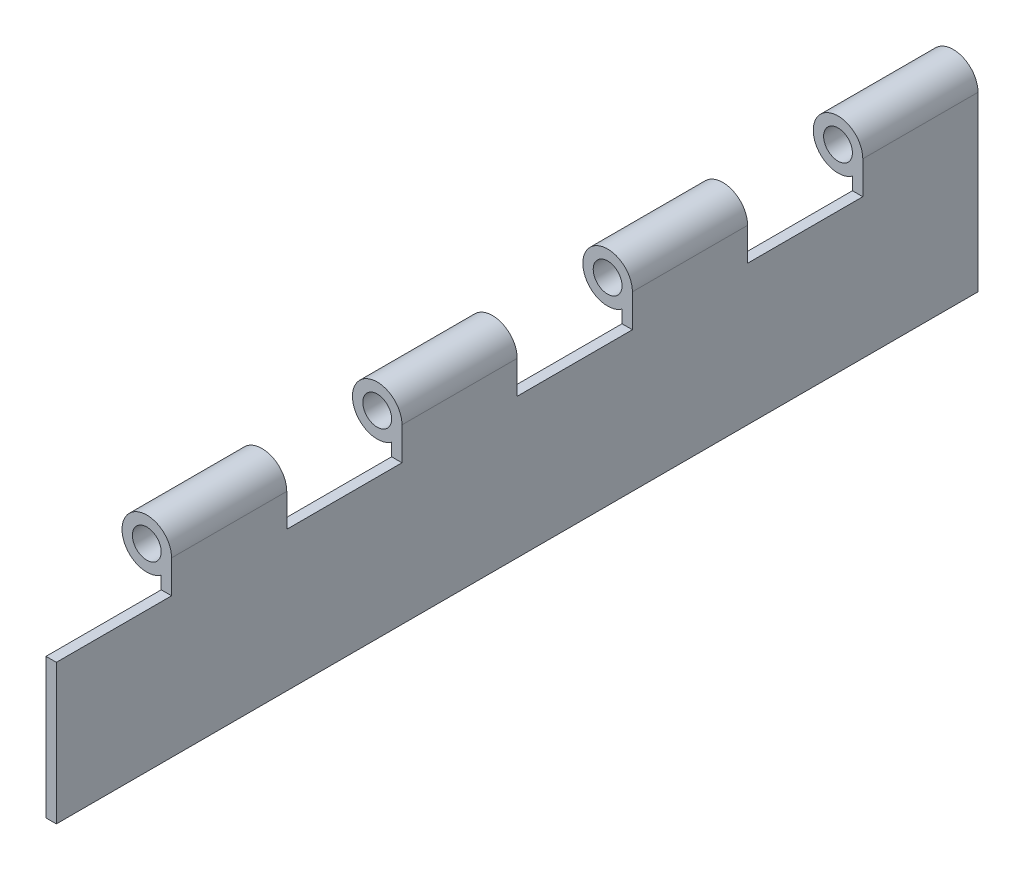
ISO-10303-21;
HEADER;
FILE_DESCRIPTION(('STEP AP214'),'2;1');
FILE_NAME('part.step','',(''),(''),'','','');
FILE_SCHEMA(('AUTOMOTIVE_DESIGN { 1 0 10303 214 1 1 1 1 }'));
ENDSEC;
DATA;
#1=APPLICATION_CONTEXT('core data for automotive mechanical design processes');
#2=APPLICATION_PROTOCOL_DEFINITION('international standard','automotive_design',2000,#1);
#3=PRODUCT_CONTEXT('',#1,'mechanical');
#4=PRODUCT('Part','Part','',(#3));
#5=PRODUCT_RELATED_PRODUCT_CATEGORY('part','',(#4));
#6=PRODUCT_DEFINITION_FORMATION('','',#4);
#7=PRODUCT_DEFINITION_CONTEXT('part definition',#1,'design');
#8=PRODUCT_DEFINITION('design','',#6,#7);
#9=PRODUCT_DEFINITION_SHAPE('','',#8);
#10=(LENGTH_UNIT() NAMED_UNIT(*) SI_UNIT(.MILLI.,.METRE.));
#11=(NAMED_UNIT(*) PLANE_ANGLE_UNIT() SI_UNIT($,.RADIAN.));
#12=(NAMED_UNIT(*) SI_UNIT($,.STERADIAN.) SOLID_ANGLE_UNIT());
#13=UNCERTAINTY_MEASURE_WITH_UNIT(LENGTH_MEASURE(1.E-05),#10,'distance_accuracy_value','');
#14=(GEOMETRIC_REPRESENTATION_CONTEXT(3) GLOBAL_UNCERTAINTY_ASSIGNED_CONTEXT((#13)) GLOBAL_UNIT_ASSIGNED_CONTEXT((#10,
#11,#12)) REPRESENTATION_CONTEXT('',''));
#15=CARTESIAN_POINT('',(0.,0.,0.));
#16=DIRECTION('',(0.,0.,1.));
#17=DIRECTION('',(1.,0.,0.));
#18=AXIS2_PLACEMENT_3D('',#15,#16,#17);
#19=CARTESIAN_POINT('',(0.,0.,203.2));
#20=DIRECTION('',(0.,0.,-1.));
#21=DIRECTION('',(-1.,0.,0.));
#22=AXIS2_PLACEMENT_3D('',#19,#20,#21);
#23=CYLINDRICAL_SURFACE('',#22,5.461);
#24=DIRECTION('',(0.,0.,-1.));
#25=VECTOR('',#24,1.);
#26=CARTESIAN_POINT('',(5.461,0.,203.2));
#27=LINE('',#26,#25);
#28=CARTESIAN_POINT('',(5.461,0.,177.8));
#29=VERTEX_POINT('',#28);
#30=CARTESIAN_POINT('',(5.461,0.,152.4));
#31=VERTEX_POINT('',#30);
#32=EDGE_CURVE('E293',#29,#31,#27,.T.);
#33=ORIENTED_EDGE('',*,*,#32,.T.);
#34=CARTESIAN_POINT('',(0.,0.,152.4));
#35=DIRECTION('',(0.,0.,1.));
#36=DIRECTION('',(1.,0.,0.));
#37=AXIS2_PLACEMENT_3D('',#34,#35,#36);
#38=CIRCLE('',#37,5.461);
#39=CARTESIAN_POINT('',(3.17500000000001,-4.44318534387211,152.4));
#40=VERTEX_POINT('',#39);
#41=EDGE_CURVE('E243',#31,#40,#38,.T.);
#42=ORIENTED_EDGE('',*,*,#41,.T.);
#43=DIRECTION('',(0.,0.,-1.));
#44=VECTOR('',#43,1.);
#45=CARTESIAN_POINT('',(3.17500000000001,-4.44318534387211,203.2));
#46=LINE('',#45,#44);
#47=CARTESIAN_POINT('',(3.17500000000001,-4.44318534387211,177.8));
#48=VERTEX_POINT('',#47);
#49=EDGE_CURVE('E11',#48,#40,#46,.T.);
#50=ORIENTED_EDGE('',*,*,#49,.F.);
#51=CARTESIAN_POINT('',(0.,0.,177.8));
#52=DIRECTION('',(0.,0.,-1.));
#53=DIRECTION('',(-1.,0.,0.));
#54=AXIS2_PLACEMENT_3D('',#51,#52,#53);
#55=CIRCLE('',#54,5.461);
#56=EDGE_CURVE('E267',#48,#29,#55,.T.);
#57=ORIENTED_EDGE('',*,*,#56,.T.);
#58=EDGE_LOOP('',(#33,#42,#50,#57));
#59=FACE_BOUND('',#58,.T.);
#60=ADVANCED_FACE('F34',(#59),#23,.T.);
#61=CARTESIAN_POINT('',(3.17500000000001,-4.44318534387211,127.));
#62=VERTEX_POINT('',#61);
#63=CARTESIAN_POINT('',(3.17500000000001,-4.44318534387211,101.6));
#64=VERTEX_POINT('',#63);
#65=EDGE_CURVE('E43',#62,#64,#46,.T.);
#66=ORIENTED_EDGE('',*,*,#65,.F.);
#67=CARTESIAN_POINT('',(0.,0.,127.));
#68=DIRECTION('',(0.,0.,-1.));
#69=DIRECTION('',(-1.,0.,0.));
#70=AXIS2_PLACEMENT_3D('',#67,#68,#69);
#71=CIRCLE('',#70,5.461);
#72=CARTESIAN_POINT('',(5.461,0.,127.));
#73=VERTEX_POINT('',#72);
#74=EDGE_CURVE('E238',#62,#73,#71,.T.);
#75=ORIENTED_EDGE('',*,*,#74,.T.);
#76=CARTESIAN_POINT('',(5.461,0.,101.6));
#77=VERTEX_POINT('',#76);
#78=EDGE_CURVE('E184',#73,#77,#27,.T.);
#79=ORIENTED_EDGE('',*,*,#78,.T.);
#80=CARTESIAN_POINT('',(0.,0.,101.6));
#81=DIRECTION('',(0.,0.,1.));
#82=DIRECTION('',(1.,0.,0.));
#83=AXIS2_PLACEMENT_3D('',#80,#81,#82);
#84=CIRCLE('',#83,5.461);
#85=EDGE_CURVE('E234',#77,#64,#84,.T.);
#86=ORIENTED_EDGE('',*,*,#85,.T.);
#87=EDGE_LOOP('',(#66,#75,#79,#86));
#88=FACE_BOUND('',#87,.T.);
#89=ADVANCED_FACE('F338',(#88),#23,.T.);
#90=CARTESIAN_POINT('',(3.17500000000001,-4.44318534387211,76.2));
#91=VERTEX_POINT('',#90);
#92=CARTESIAN_POINT('',(3.17500000000001,-4.44318534387211,50.8));
#93=VERTEX_POINT('',#92);
#94=EDGE_CURVE('E368',#91,#93,#46,.T.);
#95=ORIENTED_EDGE('',*,*,#94,.F.);
#96=CARTESIAN_POINT('',(0.,0.,76.2));
#97=DIRECTION('',(0.,0.,-1.));
#98=DIRECTION('',(-1.,0.,0.));
#99=AXIS2_PLACEMENT_3D('',#96,#97,#98);
#100=CIRCLE('',#99,5.461);
#101=CARTESIAN_POINT('',(5.461,0.,76.2));
#102=VERTEX_POINT('',#101);
#103=EDGE_CURVE('E228',#91,#102,#100,.T.);
#104=ORIENTED_EDGE('',*,*,#103,.T.);
#105=CARTESIAN_POINT('',(5.461,0.,50.8));
#106=VERTEX_POINT('',#105);
#107=EDGE_CURVE('E380',#102,#106,#27,.T.);
#108=ORIENTED_EDGE('',*,*,#107,.T.);
#109=CARTESIAN_POINT('',(0.,0.,50.8));
#110=DIRECTION('',(0.,0.,1.));
#111=DIRECTION('',(1.,0.,0.));
#112=AXIS2_PLACEMENT_3D('',#109,#110,#111);
#113=CIRCLE('',#112,5.461);
#114=EDGE_CURVE('E222',#106,#93,#113,.T.);
#115=ORIENTED_EDGE('',*,*,#114,.T.);
#116=EDGE_LOOP('',(#95,#104,#108,#115));
#117=FACE_BOUND('',#116,.T.);
#118=ADVANCED_FACE('F343',(#117),#23,.T.);
#119=CARTESIAN_POINT('',(0.,0.,203.2));
#120=DIRECTION('',(0.,0.,-1.));
#121=DIRECTION('',(-1.,0.,0.));
#122=AXIS2_PLACEMENT_3D('',#119,#120,#121);
#123=CYLINDRICAL_SURFACE('',#122,3.175);
#124=CARTESIAN_POINT('',(0.,0.,152.4));
#125=DIRECTION('',(0.,0.,1.));
#126=DIRECTION('',(1.,0.,0.));
#127=AXIS2_PLACEMENT_3D('',#124,#125,#126);
#128=CIRCLE('',#127,3.175);
#129=CARTESIAN_POINT('',(3.175,0.,152.4));
#130=VERTEX_POINT('',#129);
#131=EDGE_CURVE('E38',#130,#130,#128,.T.);
#132=ORIENTED_EDGE('',*,*,#131,.F.);
#133=EDGE_LOOP('',(#132));
#134=FACE_BOUND('',#133,.T.);
#135=CARTESIAN_POINT('',(0.,0.,177.8));
#136=DIRECTION('',(0.,0.,-1.));
#137=DIRECTION('',(-1.,0.,0.));
#138=AXIS2_PLACEMENT_3D('',#135,#136,#137);
#139=CIRCLE('',#138,3.175);
#140=CARTESIAN_POINT('',(-3.175,0.,177.8));
#141=VERTEX_POINT('',#140);
#142=EDGE_CURVE('E262',#141,#141,#139,.T.);
#143=ORIENTED_EDGE('',*,*,#142,.F.);
#144=EDGE_LOOP('',(#143));
#145=FACE_BOUND('',#144,.T.);
#146=ADVANCED_FACE('F321',(#134,#145),#123,.F.);
#147=CARTESIAN_POINT('',(0.,0.,203.2));
#148=DIRECTION('',(0.,0.,1.));
#149=DIRECTION('',(1.,0.,0.));
#150=AXIS2_PLACEMENT_3D('',#147,#148,#149);
#151=PLANE('',#150);
#152=DIRECTION('',(1.,0.,0.));
#153=VECTOR('',#152,1.);
#154=CARTESIAN_POINT('',(-5.461,-7.239,203.2));
#155=LINE('',#154,#153);
#156=CARTESIAN_POINT('',(3.17500000000001,-7.239,203.2));
#157=VERTEX_POINT('',#156);
#158=CARTESIAN_POINT('',(5.461,-7.239,203.2));
#159=VERTEX_POINT('',#158);
#160=EDGE_CURVE('E259',#157,#159,#155,.T.);
#161=ORIENTED_EDGE('',*,*,#160,.F.);
#162=DIRECTION('',(0.,-1.,0.));
#163=VECTOR('',#162,1.);
#164=CARTESIAN_POINT('',(3.17500000000001,-38.1,203.2));
#165=LINE('',#164,#163);
#166=CARTESIAN_POINT('',(3.17500000000001,-38.1,203.2));
#167=VERTEX_POINT('',#166);
#168=EDGE_CURVE('E276',#157,#167,#165,.T.);
#169=ORIENTED_EDGE('',*,*,#168,.T.);
#170=DIRECTION('',(1.,0.,0.));
#171=VECTOR('',#170,1.);
#172=CARTESIAN_POINT('',(5.461,-38.1,203.2));
#173=LINE('',#172,#171);
#174=CARTESIAN_POINT('',(5.461,-38.1,203.2));
#175=VERTEX_POINT('',#174);
#176=EDGE_CURVE('E278',#167,#175,#173,.T.);
#177=ORIENTED_EDGE('',*,*,#176,.T.);
#178=DIRECTION('',(0.,1.,0.));
#179=VECTOR('',#178,1.);
#180=CARTESIAN_POINT('',(5.461,0.,203.2));
#181=LINE('',#180,#179);
#182=EDGE_CURVE('E281',#175,#159,#181,.T.);
#183=ORIENTED_EDGE('',*,*,#182,.T.);
#184=EDGE_LOOP('',(#161,#169,#177,#183));
#185=FACE_BOUND('',#184,.T.);
#186=ADVANCED_FACE('F355',(#185),#151,.T.);
#187=CARTESIAN_POINT('',(0.,0.,0.));
#188=DIRECTION('',(0.,0.,1.));
#189=DIRECTION('',(1.,0.,0.));
#190=AXIS2_PLACEMENT_3D('',#187,#188,#189);
#191=PLANE('',#190);
#192=CARTESIAN_POINT('',(0.,0.,0.));
#193=DIRECTION('',(0.,0.,1.));
#194=DIRECTION('',(1.,0.,0.));
#195=AXIS2_PLACEMENT_3D('',#192,#193,#194);
#196=CIRCLE('',#195,5.461);
#197=CARTESIAN_POINT('',(5.461,0.,0.));
#198=VERTEX_POINT('',#197);
#199=CARTESIAN_POINT('',(3.17500000000001,-4.44318534387211,0.));
#200=VERTEX_POINT('',#199);
#201=EDGE_CURVE('E275',#198,#200,#196,.T.);
#202=ORIENTED_EDGE('',*,*,#201,.F.);
#203=DIRECTION('',(0.,1.,0.));
#204=VECTOR('',#203,1.);
#205=CARTESIAN_POINT('',(5.461,0.,0.));
#206=LINE('',#205,#204);
#207=CARTESIAN_POINT('',(5.461,-38.1,0.));
#208=VERTEX_POINT('',#207);
#209=EDGE_CURVE('E279',#208,#198,#206,.T.);
#210=ORIENTED_EDGE('',*,*,#209,.F.);
#211=DIRECTION('',(1.,0.,0.));
#212=VECTOR('',#211,1.);
#213=CARTESIAN_POINT('',(5.461,-38.1,0.));
#214=LINE('',#213,#212);
#215=CARTESIAN_POINT('',(3.17500000000001,-38.1,0.));
#216=VERTEX_POINT('',#215);
#217=EDGE_CURVE('E289',#216,#208,#214,.T.);
#218=ORIENTED_EDGE('',*,*,#217,.F.);
#219=DIRECTION('',(0.,-1.,0.));
#220=VECTOR('',#219,1.);
#221=CARTESIAN_POINT('',(3.17500000000001,-38.1,0.));
#222=LINE('',#221,#220);
#223=EDGE_CURVE('E287',#200,#216,#222,.T.);
#224=ORIENTED_EDGE('',*,*,#223,.F.);
#225=EDGE_LOOP('',(#202,#210,#218,#224));
#226=FACE_BOUND('',#225,.T.);
#227=CARTESIAN_POINT('',(0.,0.,0.));
#228=DIRECTION('',(0.,0.,1.));
#229=DIRECTION('',(1.,0.,0.));
#230=AXIS2_PLACEMENT_3D('',#227,#228,#229);
#231=CIRCLE('',#230,3.175);
#232=CARTESIAN_POINT('',(3.175,0.,0.));
#233=VERTEX_POINT('',#232);
#234=EDGE_CURVE('E272',#233,#233,#231,.T.);
#235=ORIENTED_EDGE('',*,*,#234,.T.);
#236=EDGE_LOOP('',(#235));
#237=FACE_BOUND('',#236,.T.);
#238=ADVANCED_FACE('F347',(#226,#237),#191,.F.);
#239=CARTESIAN_POINT('',(3.17500000000001,-4.44318534387211,25.4));
#240=VERTEX_POINT('',#239);
#241=EDGE_CURVE('E45',#240,#200,#46,.T.);
#242=ORIENTED_EDGE('',*,*,#241,.F.);
#243=CARTESIAN_POINT('',(0.,0.,25.4));
#244=DIRECTION('',(0.,0.,-1.));
#245=DIRECTION('',(-1.,0.,0.));
#246=AXIS2_PLACEMENT_3D('',#243,#244,#245);
#247=CIRCLE('',#246,5.461);
#248=CARTESIAN_POINT('',(5.461,0.,25.4));
#249=VERTEX_POINT('',#248);
#250=EDGE_CURVE('E216',#240,#249,#247,.T.);
#251=ORIENTED_EDGE('',*,*,#250,.T.);
#252=EDGE_CURVE('E284',#249,#198,#27,.T.);
#253=ORIENTED_EDGE('',*,*,#252,.T.);
#254=ORIENTED_EDGE('',*,*,#201,.T.);
#255=EDGE_LOOP('',(#242,#251,#253,#254));
#256=FACE_BOUND('',#255,.T.);
#257=ADVANCED_FACE('F36',(#256),#23,.T.);
#258=CARTESIAN_POINT('',(3.17500000000001,-38.1,203.2));
#259=DIRECTION('',(1.,0.,0.));
#260=DIRECTION('',(0.,1.,0.));
#261=AXIS2_PLACEMENT_3D('',#258,#259,#260);
#262=PLANE('',#261);
#263=ORIENTED_EDGE('',*,*,#49,.T.);
#264=DIRECTION('',(0.,-1.,0.));
#265=VECTOR('',#264,1.);
#266=CARTESIAN_POINT('',(3.17500000000001,-38.1,152.4));
#267=LINE('',#266,#265);
#268=CARTESIAN_POINT('',(3.17500000000001,-7.239,152.4));
#269=VERTEX_POINT('',#268);
#270=EDGE_CURVE('E240',#40,#269,#267,.T.);
#271=ORIENTED_EDGE('',*,*,#270,.T.);
#272=DIRECTION('',(0.,0.,-1.));
#273=VECTOR('',#272,1.);
#274=CARTESIAN_POINT('',(3.17500000000001,-7.239,203.2));
#275=LINE('',#274,#273);
#276=CARTESIAN_POINT('',(3.17500000000001,-7.239,127.));
#277=VERTEX_POINT('',#276);
#278=EDGE_CURVE('E251',#269,#277,#275,.T.);
#279=ORIENTED_EDGE('',*,*,#278,.T.);
#280=DIRECTION('',(0.,1.,0.));
#281=VECTOR('',#280,1.);
#282=CARTESIAN_POINT('',(3.17500000000001,-38.1,127.));
#283=LINE('',#282,#281);
#284=EDGE_CURVE('E171',#277,#62,#283,.T.);
#285=ORIENTED_EDGE('',*,*,#284,.T.);
#286=ORIENTED_EDGE('',*,*,#65,.T.);
#287=DIRECTION('',(0.,-1.,0.));
#288=VECTOR('',#287,1.);
#289=CARTESIAN_POINT('',(3.17500000000001,-38.1,101.6));
#290=LINE('',#289,#288);
#291=CARTESIAN_POINT('',(3.17500000000001,-7.239,101.6));
#292=VERTEX_POINT('',#291);
#293=EDGE_CURVE('E231',#64,#292,#290,.T.);
#294=ORIENTED_EDGE('',*,*,#293,.T.);
#295=DIRECTION('',(0.,0.,-1.));
#296=VECTOR('',#295,1.);
#297=CARTESIAN_POINT('',(3.17500000000001,-7.239,203.2));
#298=LINE('',#297,#296);
#299=CARTESIAN_POINT('',(3.17500000000001,-7.239,76.2));
#300=VERTEX_POINT('',#299);
#301=EDGE_CURVE('E248',#292,#300,#298,.T.);
#302=ORIENTED_EDGE('',*,*,#301,.T.);
#303=DIRECTION('',(0.,1.,0.));
#304=VECTOR('',#303,1.);
#305=CARTESIAN_POINT('',(3.17500000000001,-38.1,76.2));
#306=LINE('',#305,#304);
#307=EDGE_CURVE('E225',#300,#91,#306,.T.);
#308=ORIENTED_EDGE('',*,*,#307,.T.);
#309=ORIENTED_EDGE('',*,*,#94,.T.);
#310=DIRECTION('',(0.,-1.,0.));
#311=VECTOR('',#310,1.);
#312=CARTESIAN_POINT('',(3.17500000000001,-38.1,50.8));
#313=LINE('',#312,#311);
#314=CARTESIAN_POINT('',(3.17500000000001,-7.239,50.8));
#315=VERTEX_POINT('',#314);
#316=EDGE_CURVE('E219',#93,#315,#313,.T.);
#317=ORIENTED_EDGE('',*,*,#316,.T.);
#318=DIRECTION('',(0.,0.,-1.));
#319=VECTOR('',#318,1.);
#320=CARTESIAN_POINT('',(3.17500000000001,-7.239,203.2));
#321=LINE('',#320,#319);
#322=CARTESIAN_POINT('',(3.17500000000001,-7.239,25.4));
#323=VERTEX_POINT('',#322);
#324=EDGE_CURVE('E245',#315,#323,#321,.T.);
#325=ORIENTED_EDGE('',*,*,#324,.T.);
#326=DIRECTION('',(0.,1.,0.));
#327=VECTOR('',#326,1.);
#328=CARTESIAN_POINT('',(3.17500000000001,-38.1,25.4));
#329=LINE('',#328,#327);
#330=EDGE_CURVE('E213',#323,#240,#329,.T.);
#331=ORIENTED_EDGE('',*,*,#330,.T.);
#332=ORIENTED_EDGE('',*,*,#241,.T.);
#333=ORIENTED_EDGE('',*,*,#223,.T.);
#334=DIRECTION('',(0.,0.,-1.));
#335=VECTOR('',#334,1.);
#336=CARTESIAN_POINT('',(3.17500000000001,-38.1,203.2));
#337=LINE('',#336,#335);
#338=EDGE_CURVE('E299',#167,#216,#337,.T.);
#339=ORIENTED_EDGE('',*,*,#338,.F.);
#340=ORIENTED_EDGE('',*,*,#168,.F.);
#341=DIRECTION('',(0.,0.,-1.));
#342=VECTOR('',#341,1.);
#343=CARTESIAN_POINT('',(3.17500000000001,-7.239,203.2));
#344=LINE('',#343,#342);
#345=CARTESIAN_POINT('',(3.17500000000001,-7.239,177.8));
#346=VERTEX_POINT('',#345);
#347=EDGE_CURVE('E269',#157,#346,#344,.T.);
#348=ORIENTED_EDGE('',*,*,#347,.T.);
#349=DIRECTION('',(0.,1.,0.));
#350=VECTOR('',#349,1.);
#351=CARTESIAN_POINT('',(3.17500000000001,-38.1,177.8));
#352=LINE('',#351,#350);
#353=EDGE_CURVE('E264',#346,#48,#352,.T.);
#354=ORIENTED_EDGE('',*,*,#353,.T.);
#355=EDGE_LOOP('',(#263,#271,#279,#285,#286,#294,#302,#308,#309,#317,#325,#331,#332,#333,#339,
#340,#348,#354));
#356=FACE_BOUND('',#355,.T.);
#357=ADVANCED_FACE('F346',(#356),#262,.F.);
#358=CARTESIAN_POINT('',(5.461,-38.1,203.2));
#359=DIRECTION('',(0.,1.,0.));
#360=DIRECTION('',(0.,0.,1.));
#361=AXIS2_PLACEMENT_3D('',#358,#359,#360);
#362=PLANE('',#361);
#363=ORIENTED_EDGE('',*,*,#217,.T.);
#364=DIRECTION('',(0.,0.,-1.));
#365=VECTOR('',#364,1.);
#366=CARTESIAN_POINT('',(5.461,-38.1,203.2));
#367=LINE('',#366,#365);
#368=EDGE_CURVE('E296',#175,#208,#367,.T.);
#369=ORIENTED_EDGE('',*,*,#368,.F.);
#370=ORIENTED_EDGE('',*,*,#176,.F.);
#371=ORIENTED_EDGE('',*,*,#338,.T.);
#372=EDGE_LOOP('',(#363,#369,#370,#371));
#373=FACE_BOUND('',#372,.T.);
#374=ADVANCED_FACE('F353',(#373),#362,.F.);
#375=CARTESIAN_POINT('',(5.461,0.,203.2));
#376=DIRECTION('',(-1.,0.,0.));
#377=DIRECTION('',(0.,-1.,0.));
#378=AXIS2_PLACEMENT_3D('',#375,#376,#377);
#379=PLANE('',#378);
#380=DIRECTION('',(0.,0.,-1.));
#381=VECTOR('',#380,1.);
#382=CARTESIAN_POINT('',(5.461,-7.239,152.4));
#383=LINE('',#382,#381);
#384=CARTESIAN_POINT('',(5.461,-7.239,152.4));
#385=VERTEX_POINT('',#384);
#386=CARTESIAN_POINT('',(5.461,-7.239,127.));
#387=VERTEX_POINT('',#386);
#388=EDGE_CURVE('E178',#385,#387,#383,.T.);
#389=ORIENTED_EDGE('',*,*,#388,.F.);
#390=DIRECTION('',(0.,-1.,0.));
#391=VECTOR('',#390,1.);
#392=CARTESIAN_POINT('',(5.461,5.461,152.4));
#393=LINE('',#392,#391);
#394=EDGE_CURVE('E52',#31,#385,#393,.T.);
#395=ORIENTED_EDGE('',*,*,#394,.F.);
#396=ORIENTED_EDGE('',*,*,#32,.F.);
#397=DIRECTION('',(0.,1.,0.));
#398=VECTOR('',#397,1.);
#399=CARTESIAN_POINT('',(5.461,5.461,177.8));
#400=LINE('',#399,#398);
#401=CARTESIAN_POINT('',(5.461,-7.239,177.8));
#402=VERTEX_POINT('',#401);
#403=EDGE_CURVE('E256',#402,#29,#400,.T.);
#404=ORIENTED_EDGE('',*,*,#403,.F.);
#405=DIRECTION('',(0.,0.,-1.));
#406=VECTOR('',#405,1.);
#407=CARTESIAN_POINT('',(5.461,-7.239,203.2));
#408=LINE('',#407,#406);
#409=EDGE_CURVE('E253',#159,#402,#408,.T.);
#410=ORIENTED_EDGE('',*,*,#409,.F.);
#411=ORIENTED_EDGE('',*,*,#182,.F.);
#412=ORIENTED_EDGE('',*,*,#368,.T.);
#413=ORIENTED_EDGE('',*,*,#209,.T.);
#414=ORIENTED_EDGE('',*,*,#252,.F.);
#415=DIRECTION('',(0.,1.,0.));
#416=VECTOR('',#415,1.);
#417=CARTESIAN_POINT('',(5.461,5.461,25.4));
#418=LINE('',#417,#416);
#419=CARTESIAN_POINT('',(5.461,-7.239,25.4));
#420=VERTEX_POINT('',#419);
#421=EDGE_CURVE('E206',#420,#249,#418,.T.);
#422=ORIENTED_EDGE('',*,*,#421,.F.);
#423=DIRECTION('',(0.,0.,-1.));
#424=VECTOR('',#423,1.);
#425=CARTESIAN_POINT('',(5.461,-7.239,50.8));
#426=LINE('',#425,#424);
#427=CARTESIAN_POINT('',(5.461,-7.239,50.8));
#428=VERTEX_POINT('',#427);
#429=EDGE_CURVE('E203',#428,#420,#426,.T.);
#430=ORIENTED_EDGE('',*,*,#429,.F.);
#431=DIRECTION('',(0.,-1.,0.));
#432=VECTOR('',#431,1.);
#433=CARTESIAN_POINT('',(5.461,5.461,50.8));
#434=LINE('',#433,#432);
#435=EDGE_CURVE('E201',#106,#428,#434,.T.);
#436=ORIENTED_EDGE('',*,*,#435,.F.);
#437=ORIENTED_EDGE('',*,*,#107,.F.);
#438=DIRECTION('',(0.,1.,0.));
#439=VECTOR('',#438,1.);
#440=CARTESIAN_POINT('',(5.461,5.461,76.2));
#441=LINE('',#440,#439);
#442=CARTESIAN_POINT('',(5.461,-7.239,76.2));
#443=VERTEX_POINT('',#442);
#444=EDGE_CURVE('E194',#443,#102,#441,.T.);
#445=ORIENTED_EDGE('',*,*,#444,.F.);
#446=DIRECTION('',(0.,0.,-1.));
#447=VECTOR('',#446,1.);
#448=CARTESIAN_POINT('',(5.461,-7.239,101.6));
#449=LINE('',#448,#447);
#450=CARTESIAN_POINT('',(5.461,-7.239,101.6));
#451=VERTEX_POINT('',#450);
#452=EDGE_CURVE('E190',#451,#443,#449,.T.);
#453=ORIENTED_EDGE('',*,*,#452,.F.);
#454=DIRECTION('',(0.,-1.,0.));
#455=VECTOR('',#454,1.);
#456=CARTESIAN_POINT('',(5.461,5.461,101.6));
#457=LINE('',#456,#455);
#458=EDGE_CURVE('E60',#77,#451,#457,.T.);
#459=ORIENTED_EDGE('',*,*,#458,.F.);
#460=ORIENTED_EDGE('',*,*,#78,.F.);
#461=DIRECTION('',(0.,1.,0.));
#462=VECTOR('',#461,1.);
#463=CARTESIAN_POINT('',(5.461,5.461,127.));
#464=LINE('',#463,#462);
#465=EDGE_CURVE('E168',#387,#73,#464,.T.);
#466=ORIENTED_EDGE('',*,*,#465,.F.);
#467=EDGE_LOOP('',(#389,#395,#396,#404,#410,#411,#412,#413,#414,#422,#430,#436,#437,#445,#453,
#459,#460,#466));
#468=FACE_BOUND('',#467,.T.);
#469=ADVANCED_FACE('F182',(#468),#379,.F.);
#470=CARTESIAN_POINT('',(0.,0.,25.4));
#471=DIRECTION('',(0.,0.,-1.));
#472=DIRECTION('',(-1.,0.,0.));
#473=AXIS2_PLACEMENT_3D('',#470,#471,#472);
#474=CIRCLE('',#473,3.175);
#475=CARTESIAN_POINT('',(-3.175,0.,25.4));
#476=VERTEX_POINT('',#475);
#477=EDGE_CURVE('E174',#476,#476,#474,.T.);
#478=ORIENTED_EDGE('',*,*,#477,.F.);
#479=EDGE_LOOP('',(#478));
#480=FACE_BOUND('',#479,.T.);
#481=ORIENTED_EDGE('',*,*,#234,.F.);
#482=EDGE_LOOP('',(#481));
#483=FACE_BOUND('',#482,.T.);
#484=ADVANCED_FACE('F365',(#480,#483),#123,.F.);
#485=CARTESIAN_POINT('',(-5.461,-7.239,203.2));
#486=DIRECTION('',(0.,-1.,0.));
#487=DIRECTION('',(1.,0.,0.));
#488=AXIS2_PLACEMENT_3D('',#485,#486,#487);
#489=PLANE('',#488);
#490=ORIENTED_EDGE('',*,*,#160,.T.);
#491=ORIENTED_EDGE('',*,*,#409,.T.);
#492=DIRECTION('',(1.,0.,0.));
#493=VECTOR('',#492,1.);
#494=CARTESIAN_POINT('',(-5.461,-7.239,177.8));
#495=LINE('',#494,#493);
#496=EDGE_CURVE('E260',#346,#402,#495,.T.);
#497=ORIENTED_EDGE('',*,*,#496,.F.);
#498=ORIENTED_EDGE('',*,*,#347,.F.);
#499=EDGE_LOOP('',(#490,#491,#497,#498));
#500=FACE_BOUND('',#499,.T.);
#501=ADVANCED_FACE('F390',(#500),#489,.F.);
#502=CARTESIAN_POINT('',(-5.461,5.461,177.8));
#503=DIRECTION('',(0.,0.,-1.));
#504=DIRECTION('',(-1.,0.,0.));
#505=AXIS2_PLACEMENT_3D('',#502,#503,#504);
#506=PLANE('',#505);
#507=ORIENTED_EDGE('',*,*,#142,.T.);
#508=EDGE_LOOP('',(#507));
#509=FACE_BOUND('',#508,.T.);
#510=ORIENTED_EDGE('',*,*,#56,.F.);
#511=ORIENTED_EDGE('',*,*,#353,.F.);
#512=ORIENTED_EDGE('',*,*,#496,.T.);
#513=ORIENTED_EDGE('',*,*,#403,.T.);
#514=EDGE_LOOP('',(#510,#511,#512,#513));
#515=FACE_BOUND('',#514,.T.);
#516=ADVANCED_FACE('F395',(#509,#515),#506,.F.);
#517=CARTESIAN_POINT('',(-5.46100000000001,-7.239,50.8));
#518=DIRECTION('',(0.,-1.,0.));
#519=DIRECTION('',(1.,0.,0.));
#520=AXIS2_PLACEMENT_3D('',#517,#518,#519);
#521=PLANE('',#520);
#522=DIRECTION('',(1.,0.,0.));
#523=VECTOR('',#522,1.);
#524=CARTESIAN_POINT('',(-5.46100000000001,-7.239,50.8));
#525=LINE('',#524,#523);
#526=EDGE_CURVE('E209',#315,#428,#525,.T.);
#527=ORIENTED_EDGE('',*,*,#526,.T.);
#528=ORIENTED_EDGE('',*,*,#429,.T.);
#529=DIRECTION('',(1.,0.,0.));
#530=VECTOR('',#529,1.);
#531=CARTESIAN_POINT('',(-5.46100000000001,-7.239,25.4));
#532=LINE('',#531,#530);
#533=EDGE_CURVE('E191',#323,#420,#532,.T.);
#534=ORIENTED_EDGE('',*,*,#533,.F.);
#535=ORIENTED_EDGE('',*,*,#324,.F.);
#536=EDGE_LOOP('',(#527,#528,#534,#535));
#537=FACE_BOUND('',#536,.T.);
#538=ADVANCED_FACE('F412',(#537),#521,.F.);
#539=CARTESIAN_POINT('',(-5.46100000000001,5.461,50.8));
#540=DIRECTION('',(0.,0.,1.));
#541=DIRECTION('',(1.,0.,0.));
#542=AXIS2_PLACEMENT_3D('',#539,#540,#541);
#543=PLANE('',#542);
#544=CARTESIAN_POINT('',(0.,0.,50.8));
#545=DIRECTION('',(0.,0.,1.));
#546=DIRECTION('',(1.,0.,0.));
#547=AXIS2_PLACEMENT_3D('',#544,#545,#546);
#548=CIRCLE('',#547,3.175);
#549=CARTESIAN_POINT('',(3.175,0.,50.8));
#550=VERTEX_POINT('',#549);
#551=EDGE_CURVE('E218',#550,#550,#548,.T.);
#552=ORIENTED_EDGE('',*,*,#551,.T.);
#553=EDGE_LOOP('',(#552));
#554=FACE_BOUND('',#553,.T.);
#555=ORIENTED_EDGE('',*,*,#435,.T.);
#556=ORIENTED_EDGE('',*,*,#526,.F.);
#557=ORIENTED_EDGE('',*,*,#316,.F.);
#558=ORIENTED_EDGE('',*,*,#114,.F.);
#559=EDGE_LOOP('',(#555,#556,#557,#558));
#560=FACE_BOUND('',#559,.T.);
#561=ADVANCED_FACE('F410',(#554,#560),#543,.F.);
#562=CARTESIAN_POINT('',(-5.46100000000001,5.461,25.4));
#563=DIRECTION('',(0.,0.,-1.));
#564=DIRECTION('',(-1.,0.,0.));
#565=AXIS2_PLACEMENT_3D('',#562,#563,#564);
#566=PLANE('',#565);
#567=ORIENTED_EDGE('',*,*,#477,.T.);
#568=EDGE_LOOP('',(#567));
#569=FACE_BOUND('',#568,.T.);
#570=ORIENTED_EDGE('',*,*,#250,.F.);
#571=ORIENTED_EDGE('',*,*,#330,.F.);
#572=ORIENTED_EDGE('',*,*,#533,.T.);
#573=ORIENTED_EDGE('',*,*,#421,.T.);
#574=EDGE_LOOP('',(#570,#571,#572,#573));
#575=FACE_BOUND('',#574,.T.);
#576=ADVANCED_FACE('F415',(#569,#575),#566,.F.);
#577=CARTESIAN_POINT('',(0.,0.,76.2));
#578=DIRECTION('',(0.,0.,-1.));
#579=DIRECTION('',(-1.,0.,0.));
#580=AXIS2_PLACEMENT_3D('',#577,#578,#579);
#581=CIRCLE('',#580,3.175);
#582=CARTESIAN_POINT('',(-3.175,0.,76.2));
#583=VERTEX_POINT('',#582);
#584=EDGE_CURVE('E224',#583,#583,#581,.T.);
#585=ORIENTED_EDGE('',*,*,#584,.F.);
#586=EDGE_LOOP('',(#585));
#587=FACE_BOUND('',#586,.T.);
#588=ORIENTED_EDGE('',*,*,#551,.F.);
#589=EDGE_LOOP('',(#588));
#590=FACE_BOUND('',#589,.T.);
#591=ADVANCED_FACE('F320',(#587,#590),#123,.F.);
#592=CARTESIAN_POINT('',(-5.46100000000001,-7.239,101.6));
#593=DIRECTION('',(0.,-1.,0.));
#594=DIRECTION('',(1.,0.,0.));
#595=AXIS2_PLACEMENT_3D('',#592,#593,#594);
#596=PLANE('',#595);
#597=DIRECTION('',(1.,0.,0.));
#598=VECTOR('',#597,1.);
#599=CARTESIAN_POINT('',(-5.46100000000001,-7.239,101.6));
#600=LINE('',#599,#598);
#601=EDGE_CURVE('E197',#292,#451,#600,.T.);
#602=ORIENTED_EDGE('',*,*,#601,.T.);
#603=ORIENTED_EDGE('',*,*,#452,.T.);
#604=DIRECTION('',(1.,0.,0.));
#605=VECTOR('',#604,1.);
#606=CARTESIAN_POINT('',(-5.46100000000001,-7.239,76.2));
#607=LINE('',#606,#605);
#608=EDGE_CURVE('E198',#300,#443,#607,.T.);
#609=ORIENTED_EDGE('',*,*,#608,.F.);
#610=ORIENTED_EDGE('',*,*,#301,.F.);
#611=EDGE_LOOP('',(#602,#603,#609,#610));
#612=FACE_BOUND('',#611,.T.);
#613=ADVANCED_FACE('F326',(#612),#596,.F.);
#614=CARTESIAN_POINT('',(-5.46100000000001,5.461,101.6));
#615=DIRECTION('',(0.,0.,1.));
#616=DIRECTION('',(1.,0.,0.));
#617=AXIS2_PLACEMENT_3D('',#614,#615,#616);
#618=PLANE('',#617);
#619=CARTESIAN_POINT('',(0.,0.,101.6));
#620=DIRECTION('',(0.,0.,1.));
#621=DIRECTION('',(1.,0.,0.));
#622=AXIS2_PLACEMENT_3D('',#619,#620,#621);
#623=CIRCLE('',#622,3.175);
#624=CARTESIAN_POINT('',(3.175,0.,101.6));
#625=VERTEX_POINT('',#624);
#626=EDGE_CURVE('E230',#625,#625,#623,.T.);
#627=ORIENTED_EDGE('',*,*,#626,.T.);
#628=EDGE_LOOP('',(#627));
#629=FACE_BOUND('',#628,.T.);
#630=ORIENTED_EDGE('',*,*,#458,.T.);
#631=ORIENTED_EDGE('',*,*,#601,.F.);
#632=ORIENTED_EDGE('',*,*,#293,.F.);
#633=ORIENTED_EDGE('',*,*,#85,.F.);
#634=EDGE_LOOP('',(#630,#631,#632,#633));
#635=FACE_BOUND('',#634,.T.);
#636=ADVANCED_FACE('F324',(#629,#635),#618,.F.);
#637=CARTESIAN_POINT('',(-5.46100000000001,5.461,76.2));
#638=DIRECTION('',(0.,0.,-1.));
#639=DIRECTION('',(-1.,0.,0.));
#640=AXIS2_PLACEMENT_3D('',#637,#638,#639);
#641=PLANE('',#640);
#642=ORIENTED_EDGE('',*,*,#584,.T.);
#643=EDGE_LOOP('',(#642));
#644=FACE_BOUND('',#643,.T.);
#645=ORIENTED_EDGE('',*,*,#103,.F.);
#646=ORIENTED_EDGE('',*,*,#307,.F.);
#647=ORIENTED_EDGE('',*,*,#608,.T.);
#648=ORIENTED_EDGE('',*,*,#444,.T.);
#649=EDGE_LOOP('',(#645,#646,#647,#648));
#650=FACE_BOUND('',#649,.T.);
#651=ADVANCED_FACE('F318',(#644,#650),#641,.F.);
#652=CARTESIAN_POINT('',(0.,0.,127.));
#653=DIRECTION('',(0.,0.,-1.));
#654=DIRECTION('',(-1.,0.,0.));
#655=AXIS2_PLACEMENT_3D('',#652,#653,#654);
#656=CIRCLE('',#655,3.175);
#657=CARTESIAN_POINT('',(-3.175,0.,127.));
#658=VERTEX_POINT('',#657);
#659=EDGE_CURVE('E236',#658,#658,#656,.T.);
#660=ORIENTED_EDGE('',*,*,#659,.F.);
#661=EDGE_LOOP('',(#660));
#662=FACE_BOUND('',#661,.T.);
#663=ORIENTED_EDGE('',*,*,#626,.F.);
#664=EDGE_LOOP('',(#663));
#665=FACE_BOUND('',#664,.T.);
#666=ADVANCED_FACE('F315',(#662,#665),#123,.F.);
#667=CARTESIAN_POINT('',(-5.46100000000001,-7.239,152.4));
#668=DIRECTION('',(0.,-1.,0.));
#669=DIRECTION('',(1.,0.,0.));
#670=AXIS2_PLACEMENT_3D('',#667,#668,#669);
#671=PLANE('',#670);
#672=DIRECTION('',(1.,0.,0.));
#673=VECTOR('',#672,1.);
#674=CARTESIAN_POINT('',(-5.46100000000001,-7.239,152.4));
#675=LINE('',#674,#673);
#676=EDGE_CURVE('E175',#269,#385,#675,.T.);
#677=ORIENTED_EDGE('',*,*,#676,.T.);
#678=ORIENTED_EDGE('',*,*,#388,.T.);
#679=DIRECTION('',(1.,0.,0.));
#680=VECTOR('',#679,1.);
#681=CARTESIAN_POINT('',(-5.46100000000001,-7.239,127.));
#682=LINE('',#681,#680);
#683=EDGE_CURVE('E164',#277,#387,#682,.T.);
#684=ORIENTED_EDGE('',*,*,#683,.F.);
#685=ORIENTED_EDGE('',*,*,#278,.F.);
#686=EDGE_LOOP('',(#677,#678,#684,#685));
#687=FACE_BOUND('',#686,.T.);
#688=ADVANCED_FACE('F179',(#687),#671,.F.);
#689=CARTESIAN_POINT('',(-5.46100000000001,5.461,152.4));
#690=DIRECTION('',(0.,0.,1.));
#691=DIRECTION('',(1.,0.,0.));
#692=AXIS2_PLACEMENT_3D('',#689,#690,#691);
#693=PLANE('',#692);
#694=ORIENTED_EDGE('',*,*,#131,.T.);
#695=EDGE_LOOP('',(#694));
#696=FACE_BOUND('',#695,.T.);
#697=ORIENTED_EDGE('',*,*,#394,.T.);
#698=ORIENTED_EDGE('',*,*,#676,.F.);
#699=ORIENTED_EDGE('',*,*,#270,.F.);
#700=ORIENTED_EDGE('',*,*,#41,.F.);
#701=EDGE_LOOP('',(#697,#698,#699,#700));
#702=FACE_BOUND('',#701,.T.);
#703=ADVANCED_FACE('F398',(#696,#702),#693,.F.);
#704=CARTESIAN_POINT('',(-5.46100000000001,5.461,127.));
#705=DIRECTION('',(0.,0.,-1.));
#706=DIRECTION('',(-1.,0.,0.));
#707=AXIS2_PLACEMENT_3D('',#704,#705,#706);
#708=PLANE('',#707);
#709=ORIENTED_EDGE('',*,*,#659,.T.);
#710=EDGE_LOOP('',(#709));
#711=FACE_BOUND('',#710,.T.);
#712=ORIENTED_EDGE('',*,*,#74,.F.);
#713=ORIENTED_EDGE('',*,*,#284,.F.);
#714=ORIENTED_EDGE('',*,*,#683,.T.);
#715=ORIENTED_EDGE('',*,*,#465,.T.);
#716=EDGE_LOOP('',(#712,#713,#714,#715));
#717=FACE_BOUND('',#716,.T.);
#718=ADVANCED_FACE('F166',(#711,#717),#708,.F.);
#719=CLOSED_SHELL('',(#60,#89,#118,#146,#186,#238,#257,#357,#374,#469,#484,#501,#516,#538,#561,
#576,#591,#613,#636,#651,#666,#688,#703,#718));
#720=MANIFOLD_SOLID_BREP('B2',#719);
#721=ADVANCED_BREP_SHAPE_REPRESENTATION('',(#18,#720),#14);
#722=SHAPE_DEFINITION_REPRESENTATION(#9,#721);
ENDSEC;
END-ISO-10303-21;
